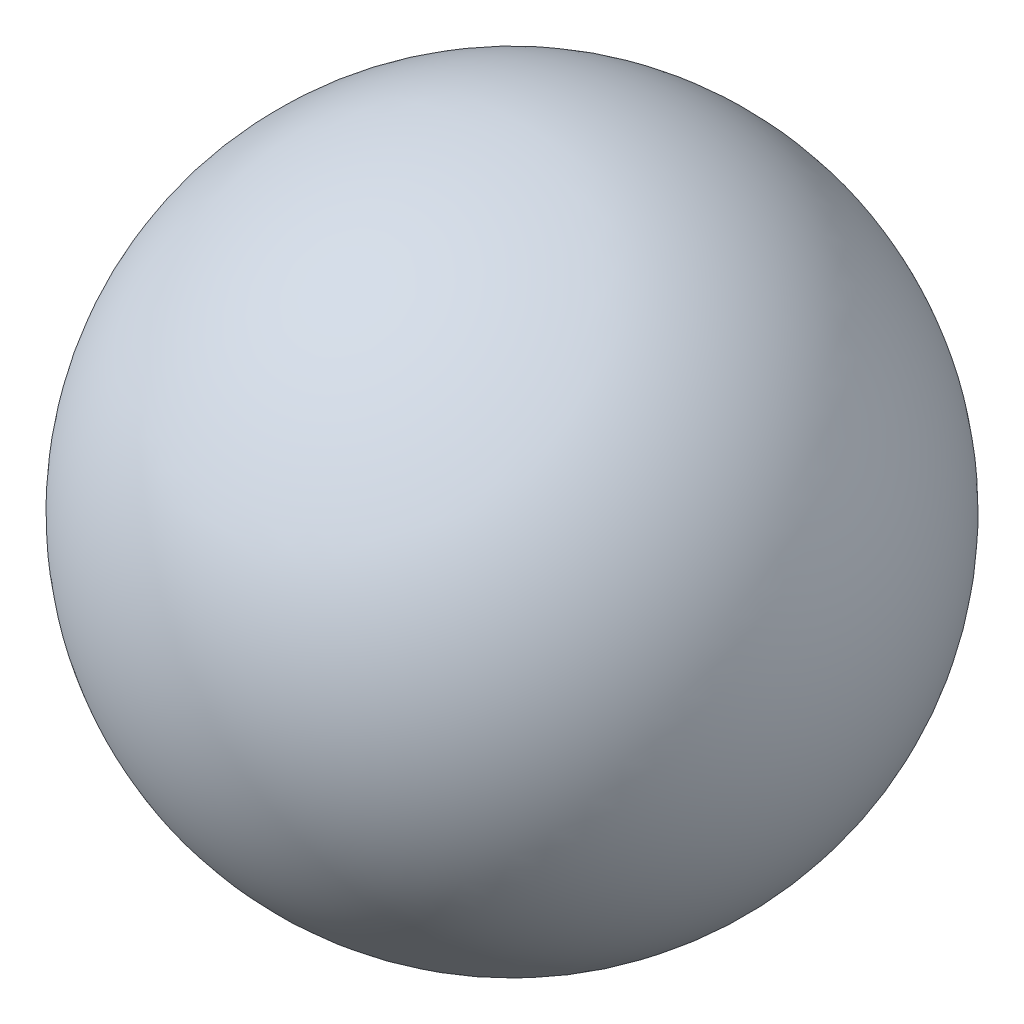
ISO-10303-21;
HEADER;
FILE_DESCRIPTION(('STEP AP214'),'2;1');
FILE_NAME('part.step','',(''),(''),'','','');
FILE_SCHEMA(('AUTOMOTIVE_DESIGN { 1 0 10303 214 1 1 1 1 }'));
ENDSEC;
DATA;
#1=APPLICATION_CONTEXT('core data for automotive mechanical design processes');
#2=APPLICATION_PROTOCOL_DEFINITION('international standard','automotive_design',2000,#1);
#3=PRODUCT_CONTEXT('',#1,'mechanical');
#4=PRODUCT('Part','Part','',(#3));
#5=PRODUCT_RELATED_PRODUCT_CATEGORY('part','',(#4));
#6=PRODUCT_DEFINITION_FORMATION('','',#4);
#7=PRODUCT_DEFINITION_CONTEXT('part definition',#1,'design');
#8=PRODUCT_DEFINITION('design','',#6,#7);
#9=PRODUCT_DEFINITION_SHAPE('','',#8);
#10=(LENGTH_UNIT() NAMED_UNIT(*) SI_UNIT(.MILLI.,.METRE.));
#11=(NAMED_UNIT(*) PLANE_ANGLE_UNIT() SI_UNIT($,.RADIAN.));
#12=(NAMED_UNIT(*) SI_UNIT($,.STERADIAN.) SOLID_ANGLE_UNIT());
#13=UNCERTAINTY_MEASURE_WITH_UNIT(LENGTH_MEASURE(1.E-05),#10,'distance_accuracy_value','');
#14=(GEOMETRIC_REPRESENTATION_CONTEXT(3) GLOBAL_UNCERTAINTY_ASSIGNED_CONTEXT((#13)) GLOBAL_UNIT_ASSIGNED_CONTEXT((#10,
#11,#12)) REPRESENTATION_CONTEXT('',''));
#15=CARTESIAN_POINT('',(0.,0.,0.));
#16=DIRECTION('',(0.,0.,1.));
#17=DIRECTION('',(1.,0.,0.));
#18=AXIS2_PLACEMENT_3D('',#15,#16,#17);
#19=CARTESIAN_POINT('',(10.1757984944672,-2.,-5.875));
#20=DIRECTION('',(0.,0.,1.));
#21=DIRECTION('',(1.,0.,0.));
#22=AXIS2_PLACEMENT_3D('',#19,#20,#21);
#23=SPHERICAL_SURFACE('',#22,1.05);
#24=CARTESIAN_POINT('',(10.1757984944672,-2.,-4.825));
#25=VERTEX_POINT('',#24);
#26=VERTEX_LOOP('',#25);
#27=FACE_BOUND('',#26,.T.);
#28=ADVANCED_FACE('F12',(#27),#23,.T.);
#29=CLOSED_SHELL('',(#28));
#30=MANIFOLD_SOLID_BREP('B1',#29);
#31=ADVANCED_BREP_SHAPE_REPRESENTATION('',(#18,#30),#14);
#32=SHAPE_DEFINITION_REPRESENTATION(#9,#31);
ENDSEC;
END-ISO-10303-21;
